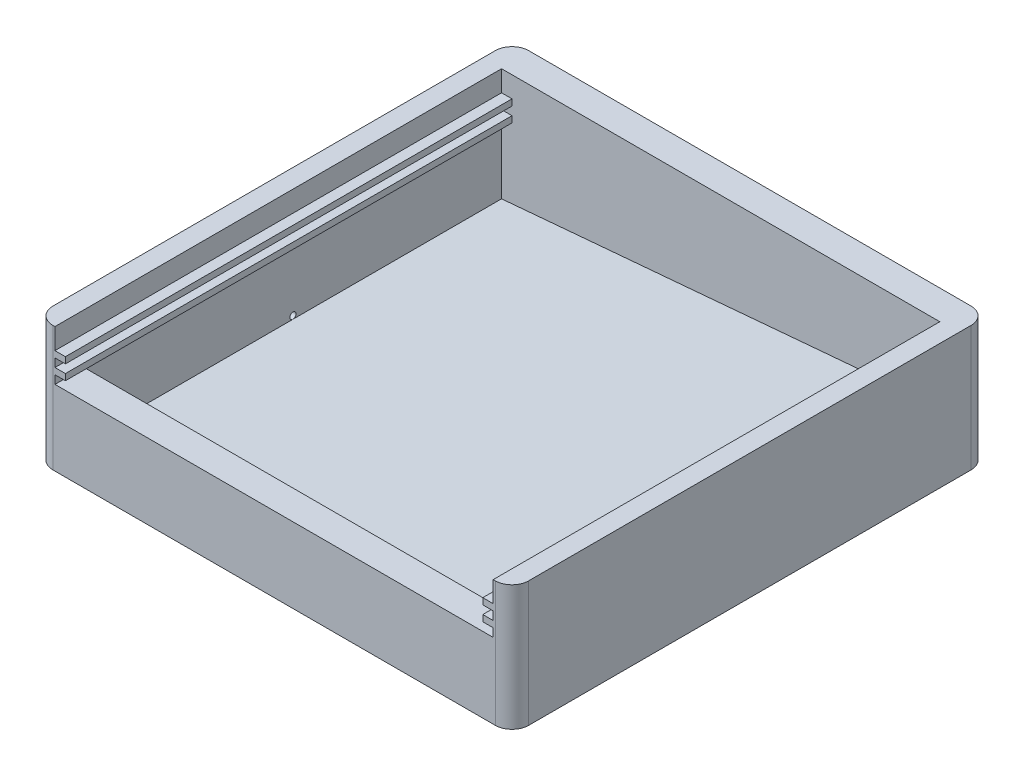
ISO-10303-21;
HEADER;
FILE_DESCRIPTION(('STEP AP214'),'2;1');
FILE_NAME('part.step','',(''),(''),'','','');
FILE_SCHEMA(('AUTOMOTIVE_DESIGN { 1 0 10303 214 1 1 1 1 }'));
ENDSEC;
DATA;
#1=APPLICATION_CONTEXT('core data for automotive mechanical design processes');
#2=APPLICATION_PROTOCOL_DEFINITION('international standard','automotive_design',2000,#1);
#3=PRODUCT_CONTEXT('',#1,'mechanical');
#4=PRODUCT('Part','Part','',(#3));
#5=PRODUCT_RELATED_PRODUCT_CATEGORY('part','',(#4));
#6=PRODUCT_DEFINITION_FORMATION('','',#4);
#7=PRODUCT_DEFINITION_CONTEXT('part definition',#1,'design');
#8=PRODUCT_DEFINITION('design','',#6,#7);
#9=PRODUCT_DEFINITION_SHAPE('','',#8);
#10=(LENGTH_UNIT() NAMED_UNIT(*) SI_UNIT(.MILLI.,.METRE.));
#11=(NAMED_UNIT(*) PLANE_ANGLE_UNIT() SI_UNIT($,.RADIAN.));
#12=(NAMED_UNIT(*) SI_UNIT($,.STERADIAN.) SOLID_ANGLE_UNIT());
#13=UNCERTAINTY_MEASURE_WITH_UNIT(LENGTH_MEASURE(1.E-05),#10,'distance_accuracy_value','');
#14=(GEOMETRIC_REPRESENTATION_CONTEXT(3) GLOBAL_UNCERTAINTY_ASSIGNED_CONTEXT((#13)) GLOBAL_UNIT_ASSIGNED_CONTEXT((#10,
#11,#12)) REPRESENTATION_CONTEXT('',''));
#15=CARTESIAN_POINT('',(0.,0.,0.));
#16=DIRECTION('',(0.,0.,1.));
#17=DIRECTION('',(1.,0.,0.));
#18=AXIS2_PLACEMENT_3D('',#15,#16,#17);
#19=CARTESIAN_POINT('',(52.5,3.,50.));
#20=DIRECTION('',(1.,0.,0.));
#21=DIRECTION('',(0.,0.,-1.));
#22=AXIS2_PLACEMENT_3D('',#19,#20,#21);
#23=PLANE('',#22);
#24=DIRECTION('',(0.,1.,0.));
#25=VECTOR('',#24,1.);
#26=CARTESIAN_POINT('',(52.5,3.,-50.));
#27=LINE('',#26,#25);
#28=CARTESIAN_POINT('',(52.5,24.9999999999999,-50.));
#29=VERTEX_POINT('',#28);
#30=CARTESIAN_POINT('',(52.5,30.,-50.));
#31=VERTEX_POINT('',#30);
#32=EDGE_CURVE('E385',#29,#31,#27,.T.);
#33=ORIENTED_EDGE('',*,*,#32,.F.);
#34=DIRECTION('',(0.,0.,1.));
#35=VECTOR('',#34,1.);
#36=CARTESIAN_POINT('',(52.5,24.9999999999999,-52.9154759474227));
#37=LINE('',#36,#35);
#38=CARTESIAN_POINT('',(52.5,24.9999999999999,57.));
#39=VERTEX_POINT('',#38);
#40=EDGE_CURVE('E284',#29,#39,#37,.T.);
#41=ORIENTED_EDGE('',*,*,#40,.T.);
#42=DIRECTION('',(0.,1.,0.));
#43=VECTOR('',#42,1.);
#44=CARTESIAN_POINT('',(52.5,18.,57.));
#45=LINE('',#44,#43);
#46=CARTESIAN_POINT('',(52.5,30.,57.));
#47=VERTEX_POINT('',#46);
#48=EDGE_CURVE('E366',#39,#47,#45,.T.);
#49=ORIENTED_EDGE('',*,*,#48,.T.);
#50=DIRECTION('',(0.,0.,-1.));
#51=VECTOR('',#50,1.);
#52=CARTESIAN_POINT('',(52.5,30.,50.));
#53=LINE('',#52,#51);
#54=EDGE_CURVE('E369',#47,#31,#53,.T.);
#55=ORIENTED_EDGE('',*,*,#54,.T.);
#56=EDGE_LOOP('',(#33,#41,#49,#55));
#57=FACE_BOUND('',#56,.T.);
#58=ADVANCED_FACE('F33',(#57),#23,.F.);
#59=CARTESIAN_POINT('',(-52.5,3.,50.));
#60=DIRECTION('',(-1.,0.,0.));
#61=DIRECTION('',(0.,0.,1.));
#62=AXIS2_PLACEMENT_3D('',#59,#60,#61);
#63=PLANE('',#62);
#64=DIRECTION('',(0.,1.,0.));
#65=VECTOR('',#64,1.);
#66=CARTESIAN_POINT('',(-52.5,3.,-50.));
#67=LINE('',#66,#65);
#68=CARTESIAN_POINT('',(-52.5,21.5,-50.));
#69=VERTEX_POINT('',#68);
#70=CARTESIAN_POINT('',(-52.5,23.5,-50.));
#71=VERTEX_POINT('',#70);
#72=EDGE_CURVE('E396',#69,#71,#67,.T.);
#73=ORIENTED_EDGE('',*,*,#72,.T.);
#74=DIRECTION('',(0.,0.,1.));
#75=VECTOR('',#74,1.);
#76=CARTESIAN_POINT('',(-52.5,23.5,-52.9154759474227));
#77=LINE('',#76,#75);
#78=CARTESIAN_POINT('',(-52.5,23.5,57.));
#79=VERTEX_POINT('',#78);
#80=EDGE_CURVE('E309',#71,#79,#77,.T.);
#81=ORIENTED_EDGE('',*,*,#80,.T.);
#82=DIRECTION('',(0.,-1.,0.));
#83=VECTOR('',#82,1.);
#84=CARTESIAN_POINT('',(-52.5,18.,57.));
#85=LINE('',#84,#83);
#86=CARTESIAN_POINT('',(-52.5,21.5,57.));
#87=VERTEX_POINT('',#86);
#88=EDGE_CURVE('E380',#79,#87,#85,.T.);
#89=ORIENTED_EDGE('',*,*,#88,.T.);
#90=DIRECTION('',(0.,0.,1.));
#91=VECTOR('',#90,1.);
#92=CARTESIAN_POINT('',(-52.5,21.5,-52.9154759474227));
#93=LINE('',#92,#91);
#94=EDGE_CURVE('E355',#69,#87,#93,.T.);
#95=ORIENTED_EDGE('',*,*,#94,.F.);
#96=EDGE_LOOP('',(#73,#81,#89,#95));
#97=FACE_BOUND('',#96,.T.);
#98=ADVANCED_FACE('F522',(#97),#63,.F.);
#99=CARTESIAN_POINT('',(52.5,21.4999999999999,57.));
#100=VERTEX_POINT('',#99);
#101=CARTESIAN_POINT('',(52.5,23.4999999999999,57.));
#102=VERTEX_POINT('',#101);
#103=EDGE_CURVE('E375',#100,#102,#45,.T.);
#104=ORIENTED_EDGE('',*,*,#103,.T.);
#105=DIRECTION('',(0.,0.,1.));
#106=VECTOR('',#105,1.);
#107=CARTESIAN_POINT('',(52.5,23.4999999999999,-52.9154759474227));
#108=LINE('',#107,#106);
#109=CARTESIAN_POINT('',(52.5,23.4999999999999,-50.));
#110=VERTEX_POINT('',#109);
#111=EDGE_CURVE('E279',#110,#102,#108,.T.);
#112=ORIENTED_EDGE('',*,*,#111,.F.);
#113=CARTESIAN_POINT('',(52.5,21.4999999999999,-50.));
#114=VERTEX_POINT('',#113);
#115=EDGE_CURVE('E400',#114,#110,#27,.T.);
#116=ORIENTED_EDGE('',*,*,#115,.F.);
#117=DIRECTION('',(0.,0.,1.));
#118=VECTOR('',#117,1.);
#119=CARTESIAN_POINT('',(52.5,21.4999999999999,-52.9154759474227));
#120=LINE('',#119,#118);
#121=EDGE_CURVE('E335',#114,#100,#120,.T.);
#122=ORIENTED_EDGE('',*,*,#121,.T.);
#123=EDGE_LOOP('',(#104,#112,#116,#122));
#124=FACE_BOUND('',#123,.T.);
#125=ADVANCED_FACE('F520',(#124),#23,.F.);
#126=DIRECTION('',(0.,0.,1.));
#127=VECTOR('',#126,1.);
#128=CARTESIAN_POINT('',(-52.5,3.,50.));
#129=LINE('',#128,#127);
#130=CARTESIAN_POINT('',(-52.5,3.,0.));
#131=VERTEX_POINT('',#130);
#132=CARTESIAN_POINT('',(-52.5,3.,50.));
#133=VERTEX_POINT('',#132);
#134=EDGE_CURVE('E233',#131,#133,#129,.T.);
#135=ORIENTED_EDGE('',*,*,#134,.F.);
#136=CARTESIAN_POINT('',(-52.5,3.75,0.));
#137=DIRECTION('',(-1.,0.,0.));
#138=DIRECTION('',(0.,0.,1.));
#139=AXIS2_PLACEMENT_3D('',#136,#137,#138);
#140=CIRCLE('',#139,0.75);
#141=EDGE_CURVE('E46',#131,#131,#140,.F.);
#142=ORIENTED_EDGE('',*,*,#141,.F.);
#143=CARTESIAN_POINT('',(-52.5,3.,-50.));
#144=VERTEX_POINT('',#143);
#145=EDGE_CURVE('E240',#144,#131,#129,.T.);
#146=ORIENTED_EDGE('',*,*,#145,.F.);
#147=CARTESIAN_POINT('',(-52.5,20.,-50.));
#148=VERTEX_POINT('',#147);
#149=EDGE_CURVE('E253',#144,#148,#67,.T.);
#150=ORIENTED_EDGE('',*,*,#149,.T.);
#151=DIRECTION('',(0.,0.,1.));
#152=VECTOR('',#151,1.);
#153=CARTESIAN_POINT('',(-52.5,20.,-52.9154759474227));
#154=LINE('',#153,#152);
#155=CARTESIAN_POINT('',(-52.5,20.,57.));
#156=VERTEX_POINT('',#155);
#157=EDGE_CURVE('E361',#148,#156,#154,.T.);
#158=ORIENTED_EDGE('',*,*,#157,.T.);
#159=CARTESIAN_POINT('',(-52.5,18.,57.));
#160=VERTEX_POINT('',#159);
#161=EDGE_CURVE('E374',#156,#160,#85,.T.);
#162=ORIENTED_EDGE('',*,*,#161,.T.);
#163=DIRECTION('',(0.,0.,1.));
#164=VECTOR('',#163,1.);
#165=CARTESIAN_POINT('',(-52.5,18.,-55.6834897228512));
#166=LINE('',#165,#164);
#167=CARTESIAN_POINT('',(-52.5,18.,50.));
#168=VERTEX_POINT('',#167);
#169=EDGE_CURVE('E248',#168,#160,#166,.T.);
#170=ORIENTED_EDGE('',*,*,#169,.F.);
#171=DIRECTION('',(0.,1.,0.));
#172=VECTOR('',#171,1.);
#173=CARTESIAN_POINT('',(-52.5,3.,50.));
#174=LINE('',#173,#172);
#175=EDGE_CURVE('E245',#133,#168,#174,.T.);
#176=ORIENTED_EDGE('',*,*,#175,.F.);
#177=EDGE_LOOP('',(#135,#142,#146,#150,#158,#162,#170,#176));
#178=FACE_BOUND('',#177,.T.);
#179=ADVANCED_FACE('F246',(#178),#63,.F.);
#180=CARTESIAN_POINT('',(57.,30.,57.));
#181=DIRECTION('',(-1.,0.,0.));
#182=DIRECTION('',(0.,0.,1.));
#183=AXIS2_PLACEMENT_3D('',#180,#181,#182);
#184=PLANE('',#183);
#185=DIRECTION('',(0.,0.,-1.));
#186=VECTOR('',#185,1.);
#187=CARTESIAN_POINT('',(57.,0.,57.));
#188=LINE('',#187,#186);
#189=CARTESIAN_POINT('',(57.,0.,53.));
#190=VERTEX_POINT('',#189);
#191=CARTESIAN_POINT('',(57.,0.,-53.));
#192=VERTEX_POINT('',#191);
#193=EDGE_CURVE('E392',#190,#192,#188,.T.);
#194=ORIENTED_EDGE('',*,*,#193,.T.);
#195=DIRECTION('',(0.,-1.,0.));
#196=VECTOR('',#195,1.);
#197=CARTESIAN_POINT('',(57.,30.,-53.));
#198=LINE('',#197,#196);
#199=CARTESIAN_POINT('',(57.,30.,-53.));
#200=VERTEX_POINT('',#199);
#201=EDGE_CURVE('E11',#192,#200,#198,.F.);
#202=ORIENTED_EDGE('',*,*,#201,.T.);
#203=DIRECTION('',(0.,0.,-1.));
#204=VECTOR('',#203,1.);
#205=CARTESIAN_POINT('',(57.,30.,57.));
#206=LINE('',#205,#204);
#207=CARTESIAN_POINT('',(57.,30.,53.));
#208=VERTEX_POINT('',#207);
#209=EDGE_CURVE('E401',#208,#200,#206,.T.);
#210=ORIENTED_EDGE('',*,*,#209,.F.);
#211=DIRECTION('',(0.,-1.,0.));
#212=VECTOR('',#211,1.);
#213=CARTESIAN_POINT('',(57.,30.,53.));
#214=LINE('',#213,#212);
#215=EDGE_CURVE('E41',#208,#190,#214,.T.);
#216=ORIENTED_EDGE('',*,*,#215,.T.);
#217=EDGE_LOOP('',(#194,#202,#210,#216));
#218=FACE_BOUND('',#217,.T.);
#219=ADVANCED_FACE('F461',(#218),#184,.F.);
#220=CARTESIAN_POINT('',(-57.,30.,-57.));
#221=DIRECTION('',(0.,0.,1.));
#222=DIRECTION('',(1.,0.,0.));
#223=AXIS2_PLACEMENT_3D('',#220,#221,#222);
#224=PLANE('',#223);
#225=DIRECTION('',(-1.,0.,0.));
#226=VECTOR('',#225,1.);
#227=CARTESIAN_POINT('',(-57.,0.,-57.));
#228=LINE('',#227,#226);
#229=CARTESIAN_POINT('',(53.,0.,-57.));
#230=VERTEX_POINT('',#229);
#231=CARTESIAN_POINT('',(-53.,0.,-57.));
#232=VERTEX_POINT('',#231);
#233=EDGE_CURVE('E418',#230,#232,#228,.T.);
#234=ORIENTED_EDGE('',*,*,#233,.T.);
#235=DIRECTION('',(0.,-1.,0.));
#236=VECTOR('',#235,1.);
#237=CARTESIAN_POINT('',(-53.,30.,-57.));
#238=LINE('',#237,#236);
#239=CARTESIAN_POINT('',(-53.,30.,-57.));
#240=VERTEX_POINT('',#239);
#241=EDGE_CURVE('E441',#232,#240,#238,.F.);
#242=ORIENTED_EDGE('',*,*,#241,.T.);
#243=DIRECTION('',(-1.,0.,0.));
#244=VECTOR('',#243,1.);
#245=CARTESIAN_POINT('',(-57.,30.,-57.));
#246=LINE('',#245,#244);
#247=CARTESIAN_POINT('',(53.,30.,-57.));
#248=VERTEX_POINT('',#247);
#249=EDGE_CURVE('E404',#248,#240,#246,.T.);
#250=ORIENTED_EDGE('',*,*,#249,.F.);
#251=DIRECTION('',(0.,-1.,0.));
#252=VECTOR('',#251,1.);
#253=CARTESIAN_POINT('',(53.,30.,-57.));
#254=LINE('',#253,#252);
#255=EDGE_CURVE('E438',#248,#230,#254,.T.);
#256=ORIENTED_EDGE('',*,*,#255,.T.);
#257=EDGE_LOOP('',(#234,#242,#250,#256));
#258=FACE_BOUND('',#257,.T.);
#259=ADVANCED_FACE('F476',(#258),#224,.F.);
#260=CARTESIAN_POINT('',(-57.,30.,57.));
#261=DIRECTION('',(1.,0.,0.));
#262=DIRECTION('',(0.,0.,-1.));
#263=AXIS2_PLACEMENT_3D('',#260,#261,#262);
#264=PLANE('',#263);
#265=CARTESIAN_POINT('',(-57.,3.75,0.));
#266=DIRECTION('',(-1.,0.,0.));
#267=DIRECTION('',(0.,0.,1.));
#268=AXIS2_PLACEMENT_3D('',#265,#266,#267);
#269=CIRCLE('',#268,1.3);
#270=CARTESIAN_POINT('',(-57.,3.75,1.3));
#271=VERTEX_POINT('',#270);
#272=EDGE_CURVE('E915',#271,#271,#269,.T.);
#273=ORIENTED_EDGE('',*,*,#272,.F.);
#274=EDGE_LOOP('',(#273));
#275=FACE_BOUND('',#274,.T.);
#276=DIRECTION('',(0.,0.,1.));
#277=VECTOR('',#276,1.);
#278=CARTESIAN_POINT('',(-57.,30.,57.));
#279=LINE('',#278,#277);
#280=CARTESIAN_POINT('',(-57.,30.,-53.));
#281=VERTEX_POINT('',#280);
#282=CARTESIAN_POINT('',(-57.,30.,53.));
#283=VERTEX_POINT('',#282);
#284=EDGE_CURVE('E408',#281,#283,#279,.T.);
#285=ORIENTED_EDGE('',*,*,#284,.F.);
#286=DIRECTION('',(0.,-1.,0.));
#287=VECTOR('',#286,1.);
#288=CARTESIAN_POINT('',(-57.,30.,-53.));
#289=LINE('',#288,#287);
#290=CARTESIAN_POINT('',(-57.,0.,-53.));
#291=VERTEX_POINT('',#290);
#292=EDGE_CURVE('E427',#281,#291,#289,.T.);
#293=ORIENTED_EDGE('',*,*,#292,.T.);
#294=DIRECTION('',(0.,0.,1.));
#295=VECTOR('',#294,1.);
#296=CARTESIAN_POINT('',(-57.,0.,57.));
#297=LINE('',#296,#295);
#298=CARTESIAN_POINT('',(-57.,0.,53.));
#299=VERTEX_POINT('',#298);
#300=EDGE_CURVE('E421',#291,#299,#297,.T.);
#301=ORIENTED_EDGE('',*,*,#300,.T.);
#302=DIRECTION('',(0.,-1.,0.));
#303=VECTOR('',#302,1.);
#304=CARTESIAN_POINT('',(-57.,30.,53.));
#305=LINE('',#304,#303);
#306=EDGE_CURVE('E415',#299,#283,#305,.F.);
#307=ORIENTED_EDGE('',*,*,#306,.T.);
#308=EDGE_LOOP('',(#285,#293,#301,#307));
#309=FACE_BOUND('',#308,.T.);
#310=ADVANCED_FACE('F487',(#275,#309),#264,.F.);
#311=CARTESIAN_POINT('',(-57.,30.,57.));
#312=DIRECTION('',(0.,0.,-1.));
#313=DIRECTION('',(-1.,0.,0.));
#314=AXIS2_PLACEMENT_3D('',#311,#312,#313);
#315=PLANE('',#314);
#316=DIRECTION('',(1.,0.,0.));
#317=VECTOR('',#316,1.);
#318=CARTESIAN_POINT('',(-57.,30.,57.));
#319=LINE('',#318,#317);
#320=CARTESIAN_POINT('',(53.,30.,57.));
#321=VERTEX_POINT('',#320);
#322=EDGE_CURVE('E411',#47,#321,#319,.T.);
#323=ORIENTED_EDGE('',*,*,#322,.F.);
#324=ORIENTED_EDGE('',*,*,#48,.F.);
#325=DIRECTION('',(-1.,0.,0.));
#326=VECTOR('',#325,1.);
#327=CARTESIAN_POINT('',(52.5,24.9999999999999,57.));
#328=LINE('',#327,#326);
#329=CARTESIAN_POINT('',(50.,24.9999999999999,57.));
#330=VERTEX_POINT('',#329);
#331=EDGE_CURVE('E263',#39,#330,#328,.T.);
#332=ORIENTED_EDGE('',*,*,#331,.T.);
#333=DIRECTION('',(0.,-1.,0.));
#334=VECTOR('',#333,1.);
#335=CARTESIAN_POINT('',(50.,24.9999999999999,57.));
#336=LINE('',#335,#334);
#337=CARTESIAN_POINT('',(50.,23.4999999999999,57.));
#338=VERTEX_POINT('',#337);
#339=EDGE_CURVE('E269',#330,#338,#336,.T.);
#340=ORIENTED_EDGE('',*,*,#339,.T.);
#341=DIRECTION('',(1.,0.,0.));
#342=VECTOR('',#341,1.);
#343=CARTESIAN_POINT('',(52.5,23.4999999999999,57.));
#344=LINE('',#343,#342);
#345=EDGE_CURVE('E265',#338,#102,#344,.T.);
#346=ORIENTED_EDGE('',*,*,#345,.T.);
#347=ORIENTED_EDGE('',*,*,#103,.F.);
#348=DIRECTION('',(-1.,0.,0.));
#349=VECTOR('',#348,1.);
#350=CARTESIAN_POINT('',(52.5,21.4999999999999,57.));
#351=LINE('',#350,#349);
#352=CARTESIAN_POINT('',(50.,21.4999999999999,57.));
#353=VERTEX_POINT('',#352);
#354=EDGE_CURVE('E314',#100,#353,#351,.T.);
#355=ORIENTED_EDGE('',*,*,#354,.T.);
#356=DIRECTION('',(0.,-1.,0.));
#357=VECTOR('',#356,1.);
#358=CARTESIAN_POINT('',(50.,19.9999999999999,57.));
#359=LINE('',#358,#357);
#360=CARTESIAN_POINT('',(50.,19.9999999999999,57.));
#361=VERTEX_POINT('',#360);
#362=EDGE_CURVE('E319',#353,#361,#359,.T.);
#363=ORIENTED_EDGE('',*,*,#362,.T.);
#364=DIRECTION('',(1.,0.,0.));
#365=VECTOR('',#364,1.);
#366=CARTESIAN_POINT('',(52.5,19.9999999999999,57.));
#367=LINE('',#366,#365);
#368=CARTESIAN_POINT('',(52.5,19.9999999999999,57.));
#369=VERTEX_POINT('',#368);
#370=EDGE_CURVE('E315',#361,#369,#367,.T.);
#371=ORIENTED_EDGE('',*,*,#370,.T.);
#372=CARTESIAN_POINT('',(52.5,18.,57.));
#373=VERTEX_POINT('',#372);
#374=EDGE_CURVE('E371',#373,#369,#45,.T.);
#375=ORIENTED_EDGE('',*,*,#374,.F.);
#376=DIRECTION('',(1.,0.,0.));
#377=VECTOR('',#376,1.);
#378=CARTESIAN_POINT('',(-52.5,18.,57.));
#379=LINE('',#378,#377);
#380=EDGE_CURVE('E379',#160,#373,#379,.T.);
#381=ORIENTED_EDGE('',*,*,#380,.F.);
#382=ORIENTED_EDGE('',*,*,#161,.F.);
#383=DIRECTION('',(1.,0.,0.));
#384=VECTOR('',#383,1.);
#385=CARTESIAN_POINT('',(-52.5,20.,57.));
#386=LINE('',#385,#384);
#387=CARTESIAN_POINT('',(-50.,20.,57.));
#388=VERTEX_POINT('',#387);
#389=EDGE_CURVE('E340',#156,#388,#386,.T.);
#390=ORIENTED_EDGE('',*,*,#389,.T.);
#391=DIRECTION('',(0.,1.,0.));
#392=VECTOR('',#391,1.);
#393=CARTESIAN_POINT('',(-50.,20.,57.));
#394=LINE('',#393,#392);
#395=CARTESIAN_POINT('',(-50.,21.5,57.));
#396=VERTEX_POINT('',#395);
#397=EDGE_CURVE('E345',#388,#396,#394,.T.);
#398=ORIENTED_EDGE('',*,*,#397,.T.);
#399=DIRECTION('',(-1.,0.,0.));
#400=VECTOR('',#399,1.);
#401=CARTESIAN_POINT('',(-52.5,21.5,57.));
#402=LINE('',#401,#400);
#403=EDGE_CURVE('E341',#396,#87,#402,.T.);
#404=ORIENTED_EDGE('',*,*,#403,.T.);
#405=ORIENTED_EDGE('',*,*,#88,.F.);
#406=DIRECTION('',(1.,0.,0.));
#407=VECTOR('',#406,1.);
#408=CARTESIAN_POINT('',(-52.5,23.5,57.));
#409=LINE('',#408,#407);
#410=CARTESIAN_POINT('',(-50.,23.5,57.));
#411=VERTEX_POINT('',#410);
#412=EDGE_CURVE('E289',#79,#411,#409,.T.);
#413=ORIENTED_EDGE('',*,*,#412,.T.);
#414=DIRECTION('',(0.,1.,0.));
#415=VECTOR('',#414,1.);
#416=CARTESIAN_POINT('',(-50.,25.,57.));
#417=LINE('',#416,#415);
#418=CARTESIAN_POINT('',(-50.,25.,57.));
#419=VERTEX_POINT('',#418);
#420=EDGE_CURVE('E294',#411,#419,#417,.T.);
#421=ORIENTED_EDGE('',*,*,#420,.T.);
#422=DIRECTION('',(-1.,0.,0.));
#423=VECTOR('',#422,1.);
#424=CARTESIAN_POINT('',(-52.5,25.,57.));
#425=LINE('',#424,#423);
#426=CARTESIAN_POINT('',(-52.5,25.,57.));
#427=VERTEX_POINT('',#426);
#428=EDGE_CURVE('E290',#419,#427,#425,.T.);
#429=ORIENTED_EDGE('',*,*,#428,.T.);
#430=CARTESIAN_POINT('',(-52.5,30.,57.));
#431=VERTEX_POINT('',#430);
#432=EDGE_CURVE('E376',#431,#427,#85,.T.);
#433=ORIENTED_EDGE('',*,*,#432,.F.);
#434=CARTESIAN_POINT('',(-53.,30.,57.));
#435=VERTEX_POINT('',#434);
#436=EDGE_CURVE('E412',#435,#431,#319,.T.);
#437=ORIENTED_EDGE('',*,*,#436,.F.);
#438=DIRECTION('',(0.,-1.,0.));
#439=VECTOR('',#438,1.);
#440=CARTESIAN_POINT('',(-53.,30.,57.));
#441=LINE('',#440,#439);
#442=CARTESIAN_POINT('',(-53.,0.,57.));
#443=VERTEX_POINT('',#442);
#444=EDGE_CURVE('E454',#435,#443,#441,.T.);
#445=ORIENTED_EDGE('',*,*,#444,.T.);
#446=DIRECTION('',(1.,0.,0.));
#447=VECTOR('',#446,1.);
#448=CARTESIAN_POINT('',(-57.,0.,57.));
#449=LINE('',#448,#447);
#450=CARTESIAN_POINT('',(53.,0.,57.));
#451=VERTEX_POINT('',#450);
#452=EDGE_CURVE('E405',#443,#451,#449,.T.);
#453=ORIENTED_EDGE('',*,*,#452,.T.);
#454=DIRECTION('',(0.,-1.,0.));
#455=VECTOR('',#454,1.);
#456=CARTESIAN_POINT('',(53.,30.,57.));
#457=LINE('',#456,#455);
#458=EDGE_CURVE('E451',#451,#321,#457,.F.);
#459=ORIENTED_EDGE('',*,*,#458,.T.);
#460=EDGE_LOOP('',(#323,#324,#332,#340,#346,#347,#355,#363,#371,#375,#381,#382,#390,#398,#404,
#405,#413,#421,#429,#433,#437,#445,#453,#459));
#461=FACE_BOUND('',#460,.T.);
#462=ADVANCED_FACE('F496',(#461),#315,.F.);
#463=CARTESIAN_POINT('',(0.,30.,0.));
#464=DIRECTION('',(0.,-1.,0.));
#465=DIRECTION('',(0.,0.,-1.));
#466=AXIS2_PLACEMENT_3D('',#463,#464,#465);
#467=PLANE('',#466);
#468=ORIENTED_EDGE('',*,*,#54,.F.);
#469=ORIENTED_EDGE('',*,*,#322,.T.);
#470=CARTESIAN_POINT('',(53.,30.,53.));
#471=DIRECTION('',(0.,-1.,0.));
#472=DIRECTION('',(0.,0.,-1.));
#473=AXIS2_PLACEMENT_3D('',#470,#471,#472);
#474=CIRCLE('',#473,4.);
#475=EDGE_CURVE('E443',#321,#208,#474,.F.);
#476=ORIENTED_EDGE('',*,*,#475,.T.);
#477=ORIENTED_EDGE('',*,*,#209,.T.);
#478=CARTESIAN_POINT('',(53.,30.,-53.));
#479=DIRECTION('',(0.,-1.,0.));
#480=DIRECTION('',(0.,0.,-1.));
#481=AXIS2_PLACEMENT_3D('',#478,#479,#480);
#482=CIRCLE('',#481,4.);
#483=EDGE_CURVE('E445',#200,#248,#482,.F.);
#484=ORIENTED_EDGE('',*,*,#483,.T.);
#485=ORIENTED_EDGE('',*,*,#249,.T.);
#486=CARTESIAN_POINT('',(-53.,30.,-53.));
#487=DIRECTION('',(0.,-1.,0.));
#488=DIRECTION('',(0.,0.,-1.));
#489=AXIS2_PLACEMENT_3D('',#486,#487,#488);
#490=CIRCLE('',#489,4.);
#491=EDGE_CURVE('E449',#240,#281,#490,.F.);
#492=ORIENTED_EDGE('',*,*,#491,.T.);
#493=ORIENTED_EDGE('',*,*,#284,.T.);
#494=CARTESIAN_POINT('',(-53.,30.,53.));
#495=DIRECTION('',(0.,-1.,0.));
#496=DIRECTION('',(0.,0.,-1.));
#497=AXIS2_PLACEMENT_3D('',#494,#495,#496);
#498=CIRCLE('',#497,4.);
#499=EDGE_CURVE('E447',#283,#435,#498,.F.);
#500=ORIENTED_EDGE('',*,*,#499,.T.);
#501=ORIENTED_EDGE('',*,*,#436,.T.);
#502=DIRECTION('',(0.,0.,1.));
#503=VECTOR('',#502,1.);
#504=CARTESIAN_POINT('',(-52.5,30.,50.));
#505=LINE('',#504,#503);
#506=CARTESIAN_POINT('',(-52.5,30.,-50.));
#507=VERTEX_POINT('',#506);
#508=EDGE_CURVE('E242',#507,#431,#505,.T.);
#509=ORIENTED_EDGE('',*,*,#508,.F.);
#510=DIRECTION('',(-1.,0.,0.));
#511=VECTOR('',#510,1.);
#512=CARTESIAN_POINT('',(-52.5,30.,-50.));
#513=LINE('',#512,#511);
#514=EDGE_CURVE('E388',#31,#507,#513,.T.);
#515=ORIENTED_EDGE('',*,*,#514,.F.);
#516=EDGE_LOOP('',(#468,#469,#476,#477,#484,#485,#492,#493,#500,#501,#509,#515));
#517=FACE_BOUND('',#516,.T.);
#518=ADVANCED_FACE('F481',(#517),#467,.F.);
#519=CARTESIAN_POINT('',(0.,0.,0.));
#520=DIRECTION('',(0.,-1.,0.));
#521=DIRECTION('',(0.,0.,-1.));
#522=AXIS2_PLACEMENT_3D('',#519,#520,#521);
#523=PLANE('',#522);
#524=ORIENTED_EDGE('',*,*,#300,.F.);
#525=CARTESIAN_POINT('',(-53.,0.,-53.));
#526=DIRECTION('',(0.,-1.,0.));
#527=DIRECTION('',(0.,0.,-1.));
#528=AXIS2_PLACEMENT_3D('',#525,#526,#527);
#529=CIRCLE('',#528,4.);
#530=EDGE_CURVE('E436',#291,#232,#529,.T.);
#531=ORIENTED_EDGE('',*,*,#530,.T.);
#532=ORIENTED_EDGE('',*,*,#233,.F.);
#533=CARTESIAN_POINT('',(53.,0.,-53.));
#534=DIRECTION('',(0.,-1.,0.));
#535=DIRECTION('',(0.,0.,-1.));
#536=AXIS2_PLACEMENT_3D('',#533,#534,#535);
#537=CIRCLE('',#536,4.);
#538=EDGE_CURVE('E432',#230,#192,#537,.T.);
#539=ORIENTED_EDGE('',*,*,#538,.T.);
#540=ORIENTED_EDGE('',*,*,#193,.F.);
#541=CARTESIAN_POINT('',(53.,0.,53.));
#542=DIRECTION('',(0.,-1.,0.));
#543=DIRECTION('',(0.,0.,-1.));
#544=AXIS2_PLACEMENT_3D('',#541,#542,#543);
#545=CIRCLE('',#544,4.);
#546=EDGE_CURVE('E430',#190,#451,#545,.T.);
#547=ORIENTED_EDGE('',*,*,#546,.T.);
#548=ORIENTED_EDGE('',*,*,#452,.F.);
#549=CARTESIAN_POINT('',(-53.,0.,53.));
#550=DIRECTION('',(0.,-1.,0.));
#551=DIRECTION('',(0.,0.,-1.));
#552=AXIS2_PLACEMENT_3D('',#549,#550,#551);
#553=CIRCLE('',#552,4.);
#554=EDGE_CURVE('E434',#443,#299,#553,.T.);
#555=ORIENTED_EDGE('',*,*,#554,.T.);
#556=EDGE_LOOP('',(#524,#531,#532,#539,#540,#547,#548,#555));
#557=FACE_BOUND('',#556,.T.);
#558=ADVANCED_FACE('F467',(#557),#523,.T.);
#559=CARTESIAN_POINT('',(-53.,30.,-53.));
#560=DIRECTION('',(0.,-1.,0.));
#561=DIRECTION('',(0.,0.,-1.));
#562=AXIS2_PLACEMENT_3D('',#559,#560,#561);
#563=CYLINDRICAL_SURFACE('',#562,4.);
#564=ORIENTED_EDGE('',*,*,#491,.F.);
#565=ORIENTED_EDGE('',*,*,#241,.F.);
#566=ORIENTED_EDGE('',*,*,#530,.F.);
#567=ORIENTED_EDGE('',*,*,#292,.F.);
#568=EDGE_LOOP('',(#564,#565,#566,#567));
#569=FACE_BOUND('',#568,.T.);
#570=ADVANCED_FACE('F485',(#569),#563,.T.);
#571=CARTESIAN_POINT('',(-53.,30.,53.));
#572=DIRECTION('',(0.,-1.,0.));
#573=DIRECTION('',(0.,0.,-1.));
#574=AXIS2_PLACEMENT_3D('',#571,#572,#573);
#575=CYLINDRICAL_SURFACE('',#574,4.);
#576=ORIENTED_EDGE('',*,*,#499,.F.);
#577=ORIENTED_EDGE('',*,*,#306,.F.);
#578=ORIENTED_EDGE('',*,*,#554,.F.);
#579=ORIENTED_EDGE('',*,*,#444,.F.);
#580=EDGE_LOOP('',(#576,#577,#578,#579));
#581=FACE_BOUND('',#580,.T.);
#582=ADVANCED_FACE('F492',(#581),#575,.T.);
#583=CARTESIAN_POINT('',(53.,30.,-53.));
#584=DIRECTION('',(0.,-1.,0.));
#585=DIRECTION('',(0.,0.,-1.));
#586=AXIS2_PLACEMENT_3D('',#583,#584,#585);
#587=CYLINDRICAL_SURFACE('',#586,4.);
#588=ORIENTED_EDGE('',*,*,#483,.F.);
#589=ORIENTED_EDGE('',*,*,#201,.F.);
#590=ORIENTED_EDGE('',*,*,#538,.F.);
#591=ORIENTED_EDGE('',*,*,#255,.F.);
#592=EDGE_LOOP('',(#588,#589,#590,#591));
#593=FACE_BOUND('',#592,.T.);
#594=ADVANCED_FACE('F473',(#593),#587,.T.);
#595=CARTESIAN_POINT('',(53.,30.,53.));
#596=DIRECTION('',(0.,-1.,0.));
#597=DIRECTION('',(0.,0.,-1.));
#598=AXIS2_PLACEMENT_3D('',#595,#596,#597);
#599=CYLINDRICAL_SURFACE('',#598,4.);
#600=ORIENTED_EDGE('',*,*,#475,.F.);
#601=ORIENTED_EDGE('',*,*,#458,.F.);
#602=ORIENTED_EDGE('',*,*,#546,.F.);
#603=ORIENTED_EDGE('',*,*,#215,.F.);
#604=EDGE_LOOP('',(#600,#601,#602,#603));
#605=FACE_BOUND('',#604,.T.);
#606=ADVANCED_FACE('F35',(#605),#599,.T.);
#607=CARTESIAN_POINT('',(52.5,12.1863096702213,-50.));
#608=VERTEX_POINT('',#607);
#609=CARTESIAN_POINT('',(52.5,19.9999999999999,-50.));
#610=VERTEX_POINT('',#609);
#611=EDGE_CURVE('E398',#608,#610,#27,.T.);
#612=ORIENTED_EDGE('',*,*,#611,.F.);
#613=DIRECTION('',(0.,0.,1.));
#614=VECTOR('',#613,1.);
#615=CARTESIAN_POINT('',(52.5,12.1863096702213,-155.401082942051));
#616=LINE('',#615,#614);
#617=CARTESIAN_POINT('',(52.5,12.1863096702213,50.));
#618=VERTEX_POINT('',#617);
#619=EDGE_CURVE('E53',#608,#618,#616,.T.);
#620=ORIENTED_EDGE('',*,*,#619,.T.);
#621=DIRECTION('',(0.,1.,0.));
#622=VECTOR('',#621,1.);
#623=CARTESIAN_POINT('',(52.5,3.,50.));
#624=LINE('',#623,#622);
#625=CARTESIAN_POINT('',(52.5,18.,50.));
#626=VERTEX_POINT('',#625);
#627=EDGE_CURVE('E252',#618,#626,#624,.T.);
#628=ORIENTED_EDGE('',*,*,#627,.T.);
#629=DIRECTION('',(0.,0.,1.));
#630=VECTOR('',#629,1.);
#631=CARTESIAN_POINT('',(52.5,18.,-55.6834897228512));
#632=LINE('',#631,#630);
#633=EDGE_CURVE('E370',#626,#373,#632,.T.);
#634=ORIENTED_EDGE('',*,*,#633,.T.);
#635=ORIENTED_EDGE('',*,*,#374,.T.);
#636=DIRECTION('',(0.,0.,1.));
#637=VECTOR('',#636,1.);
#638=CARTESIAN_POINT('',(52.5,19.9999999999999,-52.9154759474227));
#639=LINE('',#638,#637);
#640=EDGE_CURVE('E330',#610,#369,#639,.T.);
#641=ORIENTED_EDGE('',*,*,#640,.F.);
#642=EDGE_LOOP('',(#612,#620,#628,#634,#635,#641));
#643=FACE_BOUND('',#642,.T.);
#644=ADVANCED_FACE('F514',(#643),#23,.F.);
#645=CARTESIAN_POINT('',(-52.5,3.,50.));
#646=DIRECTION('',(0.,0.,1.));
#647=DIRECTION('',(1.,0.,0.));
#648=AXIS2_PLACEMENT_3D('',#645,#646,#647);
#649=PLANE('',#648);
#650=ORIENTED_EDGE('',*,*,#627,.F.);
#651=DIRECTION('',(-0.996194698091746,-0.0871557427476516,0.));
#652=VECTOR('',#651,1.);
#653=CARTESIAN_POINT('',(-52.5,3.,50.));
#654=LINE('',#653,#652);
#655=EDGE_CURVE('E237',#618,#133,#654,.T.);
#656=ORIENTED_EDGE('',*,*,#655,.T.);
#657=ORIENTED_EDGE('',*,*,#175,.T.);
#658=DIRECTION('',(-1.,0.,0.));
#659=VECTOR('',#658,1.);
#660=CARTESIAN_POINT('',(-52.5,18.,50.));
#661=LINE('',#660,#659);
#662=EDGE_CURVE('E367',#626,#168,#661,.T.);
#663=ORIENTED_EDGE('',*,*,#662,.F.);
#664=EDGE_LOOP('',(#650,#656,#657,#663));
#665=FACE_BOUND('',#664,.T.);
#666=ADVANCED_FACE('F255',(#665),#649,.F.);
#667=ORIENTED_EDGE('',*,*,#432,.T.);
#668=DIRECTION('',(0.,0.,1.));
#669=VECTOR('',#668,1.);
#670=CARTESIAN_POINT('',(-52.5,25.,-52.9154759474227));
#671=LINE('',#670,#669);
#672=CARTESIAN_POINT('',(-52.5,25.,-50.));
#673=VERTEX_POINT('',#672);
#674=EDGE_CURVE('E304',#673,#427,#671,.T.);
#675=ORIENTED_EDGE('',*,*,#674,.F.);
#676=EDGE_CURVE('E397',#673,#507,#67,.T.);
#677=ORIENTED_EDGE('',*,*,#676,.T.);
#678=ORIENTED_EDGE('',*,*,#508,.T.);
#679=EDGE_LOOP('',(#667,#675,#677,#678));
#680=FACE_BOUND('',#679,.T.);
#681=ADVANCED_FACE('F502',(#680),#63,.F.);
#682=CARTESIAN_POINT('',(-52.5,3.,-50.));
#683=DIRECTION('',(0.,0.,-1.));
#684=DIRECTION('',(-1.,0.,0.));
#685=AXIS2_PLACEMENT_3D('',#682,#683,#684);
#686=PLANE('',#685);
#687=ORIENTED_EDGE('',*,*,#149,.F.);
#688=DIRECTION('',(-0.996194698091746,-0.0871557427476516,0.));
#689=VECTOR('',#688,1.);
#690=CARTESIAN_POINT('',(-52.5,3.,-50.));
#691=LINE('',#690,#689);
#692=EDGE_CURVE('E257',#608,#144,#691,.T.);
#693=ORIENTED_EDGE('',*,*,#692,.F.);
#694=ORIENTED_EDGE('',*,*,#611,.T.);
#695=DIRECTION('',(1.,0.,0.));
#696=VECTOR('',#695,1.);
#697=CARTESIAN_POINT('',(52.5,19.9999999999999,-50.));
#698=LINE('',#697,#696);
#699=CARTESIAN_POINT('',(50.,19.9999999999999,-50.));
#700=VERTEX_POINT('',#699);
#701=EDGE_CURVE('E327',#700,#610,#698,.T.);
#702=ORIENTED_EDGE('',*,*,#701,.F.);
#703=DIRECTION('',(0.,-1.,0.));
#704=VECTOR('',#703,1.);
#705=CARTESIAN_POINT('',(50.,19.9999999999999,-50.));
#706=LINE('',#705,#704);
#707=CARTESIAN_POINT('',(50.,21.4999999999999,-50.));
#708=VERTEX_POINT('',#707);
#709=EDGE_CURVE('E332',#708,#700,#706,.T.);
#710=ORIENTED_EDGE('',*,*,#709,.F.);
#711=DIRECTION('',(-1.,0.,0.));
#712=VECTOR('',#711,1.);
#713=CARTESIAN_POINT('',(52.5,21.4999999999999,-50.));
#714=LINE('',#713,#712);
#715=EDGE_CURVE('E318',#114,#708,#714,.T.);
#716=ORIENTED_EDGE('',*,*,#715,.F.);
#717=ORIENTED_EDGE('',*,*,#115,.T.);
#718=DIRECTION('',(1.,0.,0.));
#719=VECTOR('',#718,1.);
#720=CARTESIAN_POINT('',(52.5,23.4999999999999,-50.));
#721=LINE('',#720,#719);
#722=CARTESIAN_POINT('',(50.,23.4999999999999,-50.));
#723=VERTEX_POINT('',#722);
#724=EDGE_CURVE('E277',#723,#110,#721,.T.);
#725=ORIENTED_EDGE('',*,*,#724,.F.);
#726=DIRECTION('',(0.,-1.,0.));
#727=VECTOR('',#726,1.);
#728=CARTESIAN_POINT('',(50.,24.9999999999999,-50.));
#729=LINE('',#728,#727);
#730=CARTESIAN_POINT('',(50.,24.9999999999999,-50.));
#731=VERTEX_POINT('',#730);
#732=EDGE_CURVE('E281',#731,#723,#729,.T.);
#733=ORIENTED_EDGE('',*,*,#732,.F.);
#734=DIRECTION('',(-1.,0.,0.));
#735=VECTOR('',#734,1.);
#736=CARTESIAN_POINT('',(52.5,24.9999999999999,-50.));
#737=LINE('',#736,#735);
#738=EDGE_CURVE('E268',#29,#731,#737,.T.);
#739=ORIENTED_EDGE('',*,*,#738,.F.);
#740=ORIENTED_EDGE('',*,*,#32,.T.);
#741=ORIENTED_EDGE('',*,*,#514,.T.);
#742=ORIENTED_EDGE('',*,*,#676,.F.);
#743=DIRECTION('',(-1.,0.,0.));
#744=VECTOR('',#743,1.);
#745=CARTESIAN_POINT('',(-52.5,25.,-50.));
#746=LINE('',#745,#744);
#747=CARTESIAN_POINT('',(-50.,25.,-50.));
#748=VERTEX_POINT('',#747);
#749=EDGE_CURVE('E302',#748,#673,#746,.T.);
#750=ORIENTED_EDGE('',*,*,#749,.F.);
#751=DIRECTION('',(0.,1.,0.));
#752=VECTOR('',#751,1.);
#753=CARTESIAN_POINT('',(-50.,25.,-50.));
#754=LINE('',#753,#752);
#755=CARTESIAN_POINT('',(-50.,23.5,-50.));
#756=VERTEX_POINT('',#755);
#757=EDGE_CURVE('E306',#756,#748,#754,.T.);
#758=ORIENTED_EDGE('',*,*,#757,.F.);
#759=DIRECTION('',(1.,0.,0.));
#760=VECTOR('',#759,1.);
#761=CARTESIAN_POINT('',(-52.5,23.5,-50.));
#762=LINE('',#761,#760);
#763=EDGE_CURVE('E293',#71,#756,#762,.T.);
#764=ORIENTED_EDGE('',*,*,#763,.F.);
#765=ORIENTED_EDGE('',*,*,#72,.F.);
#766=DIRECTION('',(-1.,0.,0.));
#767=VECTOR('',#766,1.);
#768=CARTESIAN_POINT('',(-52.5,21.5,-50.));
#769=LINE('',#768,#767);
#770=CARTESIAN_POINT('',(-50.,21.5,-50.));
#771=VERTEX_POINT('',#770);
#772=EDGE_CURVE('E353',#771,#69,#769,.T.);
#773=ORIENTED_EDGE('',*,*,#772,.F.);
#774=DIRECTION('',(0.,1.,0.));
#775=VECTOR('',#774,1.);
#776=CARTESIAN_POINT('',(-50.,20.,-50.));
#777=LINE('',#776,#775);
#778=CARTESIAN_POINT('',(-50.,20.,-50.));
#779=VERTEX_POINT('',#778);
#780=EDGE_CURVE('E357',#779,#771,#777,.T.);
#781=ORIENTED_EDGE('',*,*,#780,.F.);
#782=DIRECTION('',(1.,0.,0.));
#783=VECTOR('',#782,1.);
#784=CARTESIAN_POINT('',(-52.5,20.,-50.));
#785=LINE('',#784,#783);
#786=EDGE_CURVE('E344',#148,#779,#785,.T.);
#787=ORIENTED_EDGE('',*,*,#786,.F.);
#788=EDGE_LOOP('',(#687,#693,#694,#702,#710,#716,#717,#725,#733,#739,#740,#741,#742,#750,#758,
#764,#765,#773,#781,#787));
#789=FACE_BOUND('',#788,.T.);
#790=ADVANCED_FACE('F507',(#789),#686,.F.);
#791=CARTESIAN_POINT('',(-52.5,18.,-55.6834897228512));
#792=DIRECTION('',(0.,-1.,0.));
#793=DIRECTION('',(0.,0.,-1.));
#794=AXIS2_PLACEMENT_3D('',#791,#792,#793);
#795=PLANE('',#794);
#796=ORIENTED_EDGE('',*,*,#662,.T.);
#797=ORIENTED_EDGE('',*,*,#169,.T.);
#798=ORIENTED_EDGE('',*,*,#380,.T.);
#799=ORIENTED_EDGE('',*,*,#633,.F.);
#800=EDGE_LOOP('',(#796,#797,#798,#799));
#801=FACE_BOUND('',#800,.T.);
#802=ADVANCED_FACE('F565',(#801),#795,.F.);
#803=CARTESIAN_POINT('',(-52.5,20.,-52.9154759474227));
#804=DIRECTION('',(0.,-1.,0.));
#805=DIRECTION('',(0.,0.,-1.));
#806=AXIS2_PLACEMENT_3D('',#803,#804,#805);
#807=PLANE('',#806);
#808=ORIENTED_EDGE('',*,*,#157,.F.);
#809=ORIENTED_EDGE('',*,*,#786,.T.);
#810=DIRECTION('',(0.,0.,1.));
#811=VECTOR('',#810,1.);
#812=CARTESIAN_POINT('',(-50.,20.,-52.9154759474227));
#813=LINE('',#812,#811);
#814=EDGE_CURVE('E352',#779,#388,#813,.T.);
#815=ORIENTED_EDGE('',*,*,#814,.T.);
#816=ORIENTED_EDGE('',*,*,#389,.F.);
#817=EDGE_LOOP('',(#808,#809,#815,#816));
#818=FACE_BOUND('',#817,.T.);
#819=ADVANCED_FACE('F567',(#818),#807,.T.);
#820=CARTESIAN_POINT('',(-50.,20.,-52.9154759474227));
#821=DIRECTION('',(1.,0.,0.));
#822=DIRECTION('',(0.,0.,-1.));
#823=AXIS2_PLACEMENT_3D('',#820,#821,#822);
#824=PLANE('',#823);
#825=ORIENTED_EDGE('',*,*,#814,.F.);
#826=ORIENTED_EDGE('',*,*,#780,.T.);
#827=DIRECTION('',(0.,0.,1.));
#828=VECTOR('',#827,1.);
#829=CARTESIAN_POINT('',(-50.,21.5,-52.9154759474227));
#830=LINE('',#829,#828);
#831=EDGE_CURVE('E356',#771,#396,#830,.T.);
#832=ORIENTED_EDGE('',*,*,#831,.T.);
#833=ORIENTED_EDGE('',*,*,#397,.F.);
#834=EDGE_LOOP('',(#825,#826,#832,#833));
#835=FACE_BOUND('',#834,.T.);
#836=ADVANCED_FACE('F573',(#835),#824,.T.);
#837=CARTESIAN_POINT('',(-52.5,21.5,-52.9154759474227));
#838=DIRECTION('',(0.,1.,0.));
#839=DIRECTION('',(0.,0.,1.));
#840=AXIS2_PLACEMENT_3D('',#837,#838,#839);
#841=PLANE('',#840);
#842=ORIENTED_EDGE('',*,*,#831,.F.);
#843=ORIENTED_EDGE('',*,*,#772,.T.);
#844=ORIENTED_EDGE('',*,*,#94,.T.);
#845=ORIENTED_EDGE('',*,*,#403,.F.);
#846=EDGE_LOOP('',(#842,#843,#844,#845));
#847=FACE_BOUND('',#846,.T.);
#848=ADVANCED_FACE('F699',(#847),#841,.T.);
#849=CARTESIAN_POINT('',(52.5,21.4999999999999,-52.9154759474227));
#850=DIRECTION('',(0.,1.,0.));
#851=DIRECTION('',(-1.,0.,0.));
#852=AXIS2_PLACEMENT_3D('',#849,#850,#851);
#853=PLANE('',#852);
#854=ORIENTED_EDGE('',*,*,#121,.F.);
#855=ORIENTED_EDGE('',*,*,#715,.T.);
#856=DIRECTION('',(0.,0.,1.));
#857=VECTOR('',#856,1.);
#858=CARTESIAN_POINT('',(50.,21.4999999999999,-52.9154759474227));
#859=LINE('',#858,#857);
#860=EDGE_CURVE('E326',#708,#353,#859,.T.);
#861=ORIENTED_EDGE('',*,*,#860,.T.);
#862=ORIENTED_EDGE('',*,*,#354,.F.);
#863=EDGE_LOOP('',(#854,#855,#861,#862));
#864=FACE_BOUND('',#863,.T.);
#865=ADVANCED_FACE('F551',(#864),#853,.T.);
#866=CARTESIAN_POINT('',(50.,19.9999999999999,-52.9154759474227));
#867=DIRECTION('',(-1.,0.,0.));
#868=DIRECTION('',(0.,0.,1.));
#869=AXIS2_PLACEMENT_3D('',#866,#867,#868);
#870=PLANE('',#869);
#871=ORIENTED_EDGE('',*,*,#860,.F.);
#872=ORIENTED_EDGE('',*,*,#709,.T.);
#873=DIRECTION('',(0.,0.,1.));
#874=VECTOR('',#873,1.);
#875=CARTESIAN_POINT('',(50.,19.9999999999999,-52.9154759474227));
#876=LINE('',#875,#874);
#877=EDGE_CURVE('E331',#700,#361,#876,.T.);
#878=ORIENTED_EDGE('',*,*,#877,.T.);
#879=ORIENTED_EDGE('',*,*,#362,.F.);
#880=EDGE_LOOP('',(#871,#872,#878,#879));
#881=FACE_BOUND('',#880,.T.);
#882=ADVANCED_FACE('F554',(#881),#870,.T.);
#883=CARTESIAN_POINT('',(52.5,19.9999999999999,-52.9154759474227));
#884=DIRECTION('',(0.,-1.,0.));
#885=DIRECTION('',(1.,0.,0.));
#886=AXIS2_PLACEMENT_3D('',#883,#884,#885);
#887=PLANE('',#886);
#888=ORIENTED_EDGE('',*,*,#877,.F.);
#889=ORIENTED_EDGE('',*,*,#701,.T.);
#890=ORIENTED_EDGE('',*,*,#640,.T.);
#891=ORIENTED_EDGE('',*,*,#370,.F.);
#892=EDGE_LOOP('',(#888,#889,#890,#891));
#893=FACE_BOUND('',#892,.T.);
#894=ADVANCED_FACE('F559',(#893),#887,.T.);
#895=CARTESIAN_POINT('',(-52.5,23.5,-52.9154759474227));
#896=DIRECTION('',(0.,-1.,0.));
#897=DIRECTION('',(0.,0.,-1.));
#898=AXIS2_PLACEMENT_3D('',#895,#896,#897);
#899=PLANE('',#898);
#900=ORIENTED_EDGE('',*,*,#80,.F.);
#901=ORIENTED_EDGE('',*,*,#763,.T.);
#902=DIRECTION('',(0.,0.,1.));
#903=VECTOR('',#902,1.);
#904=CARTESIAN_POINT('',(-50.,23.5,-52.9154759474227));
#905=LINE('',#904,#903);
#906=EDGE_CURVE('E301',#756,#411,#905,.T.);
#907=ORIENTED_EDGE('',*,*,#906,.T.);
#908=ORIENTED_EDGE('',*,*,#412,.F.);
#909=EDGE_LOOP('',(#900,#901,#907,#908));
#910=FACE_BOUND('',#909,.T.);
#911=ADVANCED_FACE('F688',(#910),#899,.T.);
#912=CARTESIAN_POINT('',(-50.,25.,-52.9154759474227));
#913=DIRECTION('',(1.,0.,0.));
#914=DIRECTION('',(0.,0.,-1.));
#915=AXIS2_PLACEMENT_3D('',#912,#913,#914);
#916=PLANE('',#915);
#917=ORIENTED_EDGE('',*,*,#906,.F.);
#918=ORIENTED_EDGE('',*,*,#757,.T.);
#919=DIRECTION('',(0.,0.,1.));
#920=VECTOR('',#919,1.);
#921=CARTESIAN_POINT('',(-50.,25.,-52.9154759474227));
#922=LINE('',#921,#920);
#923=EDGE_CURVE('E305',#748,#419,#922,.T.);
#924=ORIENTED_EDGE('',*,*,#923,.T.);
#925=ORIENTED_EDGE('',*,*,#420,.F.);
#926=EDGE_LOOP('',(#917,#918,#924,#925));
#927=FACE_BOUND('',#926,.T.);
#928=ADVANCED_FACE('F684',(#927),#916,.T.);
#929=CARTESIAN_POINT('',(-52.5,25.,-52.9154759474227));
#930=DIRECTION('',(0.,1.,0.));
#931=DIRECTION('',(0.,0.,1.));
#932=AXIS2_PLACEMENT_3D('',#929,#930,#931);
#933=PLANE('',#932);
#934=ORIENTED_EDGE('',*,*,#923,.F.);
#935=ORIENTED_EDGE('',*,*,#749,.T.);
#936=ORIENTED_EDGE('',*,*,#674,.T.);
#937=ORIENTED_EDGE('',*,*,#428,.F.);
#938=EDGE_LOOP('',(#934,#935,#936,#937));
#939=FACE_BOUND('',#938,.T.);
#940=ADVANCED_FACE('F680',(#939),#933,.T.);
#941=CARTESIAN_POINT('',(52.5,24.9999999999999,-52.9154759474227));
#942=DIRECTION('',(0.,1.,0.));
#943=DIRECTION('',(-1.,0.,0.));
#944=AXIS2_PLACEMENT_3D('',#941,#942,#943);
#945=PLANE('',#944);
#946=ORIENTED_EDGE('',*,*,#40,.F.);
#947=ORIENTED_EDGE('',*,*,#738,.T.);
#948=DIRECTION('',(0.,0.,1.));
#949=VECTOR('',#948,1.);
#950=CARTESIAN_POINT('',(50.,24.9999999999999,-52.9154759474227));
#951=LINE('',#950,#949);
#952=EDGE_CURVE('E276',#731,#330,#951,.T.);
#953=ORIENTED_EDGE('',*,*,#952,.T.);
#954=ORIENTED_EDGE('',*,*,#331,.F.);
#955=EDGE_LOOP('',(#946,#947,#953,#954));
#956=FACE_BOUND('',#955,.T.);
#957=ADVANCED_FACE('F676',(#956),#945,.T.);
#958=CARTESIAN_POINT('',(50.,24.9999999999999,-52.9154759474227));
#959=DIRECTION('',(-1.,0.,0.));
#960=DIRECTION('',(0.,0.,1.));
#961=AXIS2_PLACEMENT_3D('',#958,#959,#960);
#962=PLANE('',#961);
#963=ORIENTED_EDGE('',*,*,#952,.F.);
#964=ORIENTED_EDGE('',*,*,#732,.T.);
#965=DIRECTION('',(0.,0.,1.));
#966=VECTOR('',#965,1.);
#967=CARTESIAN_POINT('',(50.,23.4999999999999,-52.9154759474227));
#968=LINE('',#967,#966);
#969=EDGE_CURVE('E280',#723,#338,#968,.T.);
#970=ORIENTED_EDGE('',*,*,#969,.T.);
#971=ORIENTED_EDGE('',*,*,#339,.F.);
#972=EDGE_LOOP('',(#963,#964,#970,#971));
#973=FACE_BOUND('',#972,.T.);
#974=ADVANCED_FACE('F673',(#973),#962,.T.);
#975=CARTESIAN_POINT('',(52.5,23.4999999999999,-52.9154759474227));
#976=DIRECTION('',(0.,-1.,0.));
#977=DIRECTION('',(1.,0.,0.));
#978=AXIS2_PLACEMENT_3D('',#975,#976,#977);
#979=PLANE('',#978);
#980=ORIENTED_EDGE('',*,*,#969,.F.);
#981=ORIENTED_EDGE('',*,*,#724,.T.);
#982=ORIENTED_EDGE('',*,*,#111,.T.);
#983=ORIENTED_EDGE('',*,*,#345,.F.);
#984=EDGE_LOOP('',(#980,#981,#982,#983));
#985=FACE_BOUND('',#984,.T.);
#986=ADVANCED_FACE('F545',(#985),#979,.T.);
#987=CARTESIAN_POINT('',(-52.5,3.,-155.401082942051));
#988=DIRECTION('',(-0.0871557427476516,0.996194698091746,0.));
#989=DIRECTION('',(-0.996194698091746,-0.0871557427476516,0.));
#990=AXIS2_PLACEMENT_3D('',#987,#988,#989);
#991=PLANE('',#990);
#992=ORIENTED_EDGE('',*,*,#619,.F.);
#993=ORIENTED_EDGE('',*,*,#692,.T.);
#994=ORIENTED_EDGE('',*,*,#145,.T.);
#995=ORIENTED_EDGE('',*,*,#134,.T.);
#996=ORIENTED_EDGE('',*,*,#655,.F.);
#997=EDGE_LOOP('',(#992,#993,#994,#995,#996));
#998=FACE_BOUND('',#997,.T.);
#999=ADVANCED_FACE('F235',(#998),#991,.T.);
#1000=CARTESIAN_POINT('',(-50.3786796564404,3.75,0.));
#1001=DIRECTION('',(-1.,0.,0.));
#1002=DIRECTION('',(0.,0.,1.));
#1003=AXIS2_PLACEMENT_3D('',#1000,#1001,#1002);
#1004=CYLINDRICAL_SURFACE('',#1003,0.75);
#1005=ORIENTED_EDGE('',*,*,#141,.T.);
#1006=EDGE_LOOP('',(#1005));
#1007=FACE_BOUND('',#1006,.T.);
#1008=CARTESIAN_POINT('',(-62.,3.75,0.));
#1009=DIRECTION('',(-1.,0.,0.));
#1010=DIRECTION('',(0.,0.,1.));
#1011=AXIS2_PLACEMENT_3D('',#1008,#1009,#1010);
#1012=CIRCLE('',#1011,0.750000000000001);
#1013=CARTESIAN_POINT('',(-62.,3.75,0.750000000000001));
#1014=VERTEX_POINT('',#1013);
#1015=EDGE_CURVE('E259',#1014,#1014,#1012,.T.);
#1016=ORIENTED_EDGE('',*,*,#1015,.T.);
#1017=EDGE_LOOP('',(#1016));
#1018=FACE_BOUND('',#1017,.T.);
#1019=ADVANCED_FACE('F607',(#1007,#1018),#1004,.F.);
#1020=CARTESIAN_POINT('',(-62.,3.,0.));
#1021=DIRECTION('',(-1.,0.,0.));
#1022=DIRECTION('',(0.,0.,1.));
#1023=AXIS2_PLACEMENT_3D('',#1020,#1021,#1022);
#1024=PLANE('',#1023);
#1025=CARTESIAN_POINT('',(-62.,3.75,0.));
#1026=DIRECTION('',(-1.,0.,0.));
#1027=DIRECTION('',(0.,0.,1.));
#1028=AXIS2_PLACEMENT_3D('',#1025,#1026,#1027);
#1029=CIRCLE('',#1028,1.);
#1030=CARTESIAN_POINT('',(-62.,3.75,1.));
#1031=VERTEX_POINT('',#1030);
#1032=EDGE_CURVE('E922',#1031,#1031,#1029,.T.);
#1033=ORIENTED_EDGE('',*,*,#1032,.T.);
#1034=EDGE_LOOP('',(#1033));
#1035=FACE_BOUND('',#1034,.T.);
#1036=ORIENTED_EDGE('',*,*,#1015,.F.);
#1037=EDGE_LOOP('',(#1036));
#1038=FACE_BOUND('',#1037,.T.);
#1039=ADVANCED_FACE('F625',(#1035,#1038),#1024,.T.);
#1040=CARTESIAN_POINT('',(-62.,3.75,0.));
#1041=DIRECTION('',(1.,0.,0.));
#1042=DIRECTION('',(0.,0.,-1.));
#1043=AXIS2_PLACEMENT_3D('',#1040,#1041,#1042);
#1044=CONICAL_SURFACE('',#1043,1.,0.18131977440149);
#1045=CARTESIAN_POINT('',(-59.,3.75,0.));
#1046=DIRECTION('',(-1.,0.,0.));
#1047=DIRECTION('',(0.,0.,1.));
#1048=AXIS2_PLACEMENT_3D('',#1045,#1046,#1047);
#1049=CIRCLE('',#1048,1.55);
#1050=CARTESIAN_POINT('',(-59.,3.75,1.55));
#1051=VERTEX_POINT('',#1050);
#1052=EDGE_CURVE('E919',#1051,#1051,#1049,.T.);
#1053=ORIENTED_EDGE('',*,*,#1052,.T.);
#1054=EDGE_LOOP('',(#1053));
#1055=FACE_BOUND('',#1054,.T.);
#1056=ORIENTED_EDGE('',*,*,#1032,.F.);
#1057=EDGE_LOOP('',(#1056));
#1058=FACE_BOUND('',#1057,.T.);
#1059=ADVANCED_FACE('F635',(#1055,#1058),#1044,.T.);
#1060=CARTESIAN_POINT('',(-59.,2.2,0.));
#1061=DIRECTION('',(1.,0.,0.));
#1062=DIRECTION('',(0.,0.,-1.));
#1063=AXIS2_PLACEMENT_3D('',#1060,#1061,#1062);
#1064=PLANE('',#1063);
#1065=CARTESIAN_POINT('',(-59.,3.75,0.));
#1066=DIRECTION('',(-1.,0.,0.));
#1067=DIRECTION('',(0.,0.,1.));
#1068=AXIS2_PLACEMENT_3D('',#1065,#1066,#1067);
#1069=CIRCLE('',#1068,1.3);
#1070=CARTESIAN_POINT('',(-59.,3.75,1.3));
#1071=VERTEX_POINT('',#1070);
#1072=EDGE_CURVE('E918',#1071,#1071,#1069,.T.);
#1073=ORIENTED_EDGE('',*,*,#1072,.T.);
#1074=EDGE_LOOP('',(#1073));
#1075=FACE_BOUND('',#1074,.T.);
#1076=ORIENTED_EDGE('',*,*,#1052,.F.);
#1077=EDGE_LOOP('',(#1076));
#1078=FACE_BOUND('',#1077,.T.);
#1079=ADVANCED_FACE('F645',(#1075,#1078),#1064,.T.);
#1080=CARTESIAN_POINT('',(-57.,3.75,0.));
#1081=DIRECTION('',(-1.,0.,0.));
#1082=DIRECTION('',(0.,0.,1.));
#1083=AXIS2_PLACEMENT_3D('',#1080,#1081,#1082);
#1084=CYLINDRICAL_SURFACE('',#1083,1.3);
#1085=ORIENTED_EDGE('',*,*,#272,.T.);
#1086=EDGE_LOOP('',(#1085));
#1087=FACE_BOUND('',#1086,.T.);
#1088=ORIENTED_EDGE('',*,*,#1072,.F.);
#1089=EDGE_LOOP('',(#1088));
#1090=FACE_BOUND('',#1089,.T.);
#1091=ADVANCED_FACE('F655',(#1087,#1090),#1084,.T.);
#1092=CLOSED_SHELL('',(#58,#98,#125,#179,#219,#259,#310,#462,#518,#558,#570,#582,#594,#606,#644,
#666,#681,#790,#802,#819,#836,#848,#865,#882,#894,#911,#928,#940,#957,#974,#986,#999,#1019,
#1039,#1059,#1079,#1091));
#1093=MANIFOLD_SOLID_BREP('B2',#1092);
#1094=ADVANCED_BREP_SHAPE_REPRESENTATION('',(#18,#1093),#14);
#1095=SHAPE_DEFINITION_REPRESENTATION(#9,#1094);
ENDSEC;
END-ISO-10303-21;
